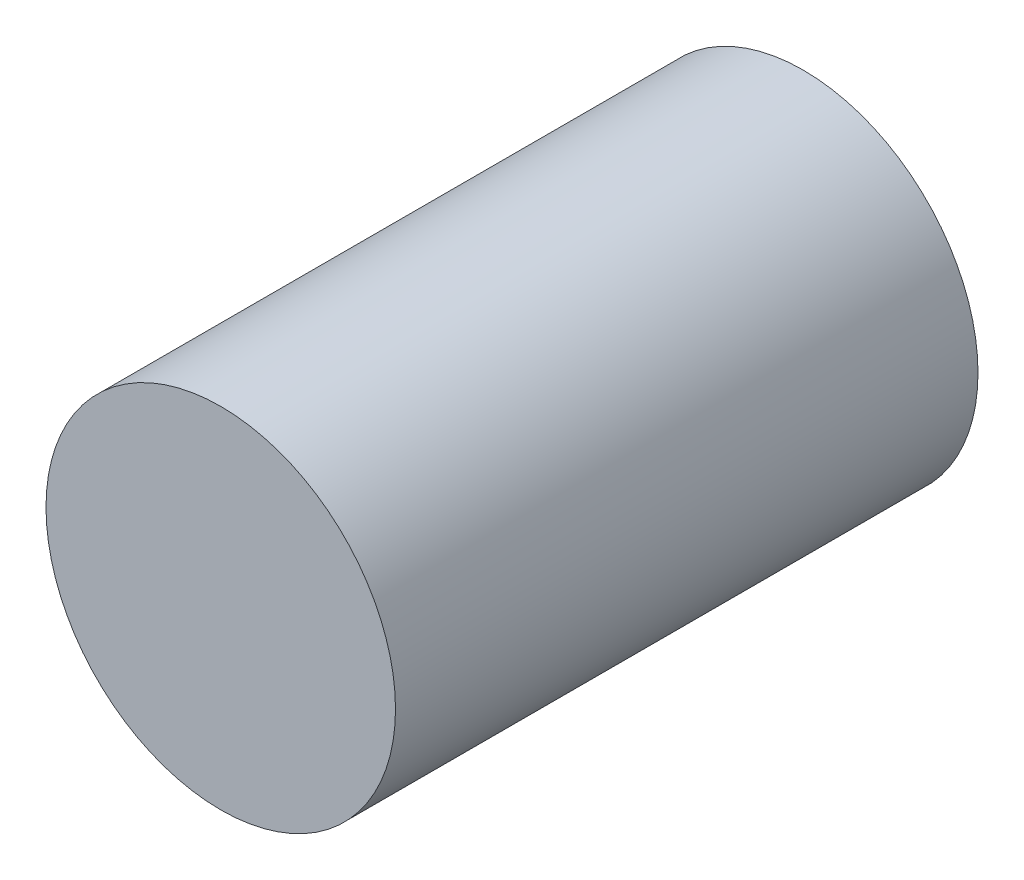
ISO-10303-21;
HEADER;
FILE_DESCRIPTION(('STEP AP214'),'2;1');
FILE_NAME('part.step','',(''),(''),'','','');
FILE_SCHEMA(('AUTOMOTIVE_DESIGN { 1 0 10303 214 1 1 1 1 }'));
ENDSEC;
DATA;
#1=APPLICATION_CONTEXT('core data for automotive mechanical design processes');
#2=APPLICATION_PROTOCOL_DEFINITION('international standard','automotive_design',2000,#1);
#3=PRODUCT_CONTEXT('',#1,'mechanical');
#4=PRODUCT('Part','Part','',(#3));
#5=PRODUCT_RELATED_PRODUCT_CATEGORY('part','',(#4));
#6=PRODUCT_DEFINITION_FORMATION('','',#4);
#7=PRODUCT_DEFINITION_CONTEXT('part definition',#1,'design');
#8=PRODUCT_DEFINITION('design','',#6,#7);
#9=PRODUCT_DEFINITION_SHAPE('','',#8);
#10=(LENGTH_UNIT() NAMED_UNIT(*) SI_UNIT(.MILLI.,.METRE.));
#11=(NAMED_UNIT(*) PLANE_ANGLE_UNIT() SI_UNIT($,.RADIAN.));
#12=(NAMED_UNIT(*) SI_UNIT($,.STERADIAN.) SOLID_ANGLE_UNIT());
#13=UNCERTAINTY_MEASURE_WITH_UNIT(LENGTH_MEASURE(1.E-05),#10,'distance_accuracy_value','');
#14=(GEOMETRIC_REPRESENTATION_CONTEXT(3) GLOBAL_UNCERTAINTY_ASSIGNED_CONTEXT((#13)) GLOBAL_UNIT_ASSIGNED_CONTEXT((#10,
#11,#12)) REPRESENTATION_CONTEXT('',''));
#15=CARTESIAN_POINT('',(0.,0.,0.));
#16=DIRECTION('',(0.,0.,1.));
#17=DIRECTION('',(1.,0.,0.));
#18=AXIS2_PLACEMENT_3D('',#15,#16,#17);
#19=CARTESIAN_POINT('',(0.,0.,50.));
#20=DIRECTION('',(0.,0.,-1.));
#21=DIRECTION('',(-1.,0.,0.));
#22=AXIS2_PLACEMENT_3D('',#19,#20,#21);
#23=CYLINDRICAL_SURFACE('',#22,15.);
#24=CARTESIAN_POINT('',(0.,-15.,29.9254234471279));
#25=CARTESIAN_POINT('',(0.272816814433608,-15.0000007650471,29.9254247157861));
#26=CARTESIAN_POINT('',(0.54562597269272,-14.9924884753769,29.9030221164919));
#27=CARTESIAN_POINT('',(1.08320880436489,-14.9632605101644,29.8142779030418));
#28=CARTESIAN_POINT('',(1.3479816405942,-14.941543360109,29.7479317273831));
#29=CARTESIAN_POINT('',(1.86166394750877,-14.8862653953208,29.5738272302078));
#30=CARTESIAN_POINT('',(2.11059912942976,-14.8527243865377,29.4661381348321));
#31=CARTESIAN_POINT('',(2.58687468402704,-14.7772222858721,29.2127175829356));
#32=CARTESIAN_POINT('',(2.81421078479507,-14.7352595334076,29.0669786221128));
#33=CARTESIAN_POINT('',(3.24870837510974,-14.6457047221309,28.7362944228363));
#34=CARTESIAN_POINT('',(3.45501850148552,-14.5979778231161,28.5502672758336));
#35=CARTESIAN_POINT('',(3.83416346351645,-14.5030157392292,28.1465876735869));
#36=CARTESIAN_POINT('',(4.00699092746984,-14.4557806648007,27.9289282724548));
#37=CARTESIAN_POINT('',(4.31912471111899,-14.3656666235818,27.4604978711728));
#38=CARTESIAN_POINT('',(4.45732429102252,-14.3229519627198,27.2089547485771));
#39=CARTESIAN_POINT('',(4.68909436930558,-14.2487652698844,26.684542974949));
#40=CARTESIAN_POINT('',(4.78267848691248,-14.2172898077928,26.4116808613493));
#41=CARTESIAN_POINT('',(4.91936730756488,-14.1705651637056,25.8620573396167));
#42=CARTESIAN_POINT('',(4.96406724136036,-14.1548047884338,25.5857374046681));
#43=CARTESIAN_POINT('',(5.00670561667087,-14.1397828315221,25.0291046763629));
#44=CARTESIAN_POINT('',(5.00465850803659,-14.1405161515599,24.748793143612));
#45=CARTESIAN_POINT('',(4.95509951850356,-14.1579507500054,24.2057402948667));
#46=CARTESIAN_POINT('',(4.90966956578088,-14.1739207918415,23.9427814324093));
#47=CARTESIAN_POINT('',(4.77803081419367,-14.2188328846856,23.4284563489773));
#48=CARTESIAN_POINT('',(4.69181713294739,-14.2477764887883,23.1770915199256));
#49=CARTESIAN_POINT('',(4.47969529031769,-14.3158955569848,22.6883596992082));
#50=CARTESIAN_POINT('',(4.35317024354078,-14.3552282897692,22.4512833197904));
#51=CARTESIAN_POINT('',(4.06444553151123,-14.4396279286729,22.0010689057191));
#52=CARTESIAN_POINT('',(3.9022355618188,-14.4846964894921,21.7879378124582));
#53=CARTESIAN_POINT('',(3.53674666341248,-14.5783664584198,21.379965456327));
#54=CARTESIAN_POINT('',(3.3317657503819,-14.6270294677509,21.1866599745833));
#55=CARTESIAN_POINT('',(2.89169784984998,-14.7203469193431,20.8367671138101));
#56=CARTESIAN_POINT('',(2.65660797830398,-14.765000976901,20.6801832563052));
#57=CARTESIAN_POINT('',(2.15973806523143,-14.8458553968921,20.4069419459528));
#58=CARTESIAN_POINT('',(1.89771638208171,-14.8819675004026,20.2906959904243));
#59=CARTESIAN_POINT('',(1.35634541682251,-14.9410283572211,20.1044075773493));
#60=CARTESIAN_POINT('',(1.07700219077476,-14.9639816827438,20.0343490700107));
#61=CARTESIAN_POINT('',(0.521919147646527,-14.9933813535722,19.9451451170161));
#62=CARTESIAN_POINT('',(0.246547999324233,-15.0005000916864,19.9239244012641));
#63=CARTESIAN_POINT('',(-0.303875349801188,-14.9994451347413,19.9270868151202));
#64=CARTESIAN_POINT('',(-0.578927596598252,-14.9912740209681,19.9514622470273));
#65=CARTESIAN_POINT('',(-1.11259933152128,-14.9610012358552,20.0434829858077));
#66=CARTESIAN_POINT('',(-1.37146403417422,-14.9393099355596,20.1098544773754));
#67=CARTESIAN_POINT('',(-1.87427979289787,-14.8845923415035,20.2823906694615));
#68=CARTESIAN_POINT('',(-2.11822894254303,-14.8515646023338,20.3885604444668));
#69=CARTESIAN_POINT('',(-2.59144148196637,-14.7764465643645,20.6407756063318));
#70=CARTESIAN_POINT('',(-2.82014979608574,-14.7341407377893,20.7877964135438));
#71=CARTESIAN_POINT('',(-3.25032415067793,-14.6452626958131,21.1163941971953));
#72=CARTESIAN_POINT('',(-3.45178183897788,-14.5986891796914,21.2979817272867));
#73=CARTESIAN_POINT('',(-3.8312625390315,-14.5038423990222,21.7003172021608));
#74=CARTESIAN_POINT('',(-4.00780484622885,-14.4555880543714,21.9224695817622));
#75=CARTESIAN_POINT('',(-4.32128761161787,-14.3649986647354,22.3942812861823));
#76=CARTESIAN_POINT('',(-4.45822773965506,-14.3226636691001,22.6439408402983));
#77=CARTESIAN_POINT('',(-4.68798465208181,-14.2491195895692,23.1637885235774));
#78=CARTESIAN_POINT('',(-4.78089066082511,-14.2178880396489,23.4339338429717));
#79=CARTESIAN_POINT('',(-4.91947333379678,-14.1705416153225,23.9873166973486));
#80=CARTESIAN_POINT('',(-4.9651712747697,-14.154419931182,24.2705482741497));
#81=CARTESIAN_POINT('',(-5.00638141238671,-14.1398929437089,24.8264089273325));
#82=CARTESIAN_POINT('',(-5.004351286542,-14.1406200128708,25.098835148562));
#83=CARTESIAN_POINT('',(-4.95621146724347,-14.1575634911934,25.6392488217382));
#84=CARTESIAN_POINT('',(-4.91010439729293,-14.1737789784681,25.9072365369033));
#85=CARTESIAN_POINT('',(-4.77685906564673,-14.2192262152446,26.4261017621403));
#86=CARTESIAN_POINT('',(-4.69051673007757,-14.2482049011239,26.6772075721504));
#87=CARTESIAN_POINT('',(-4.47989682879874,-14.3158199409234,27.1615604818192));
#88=CARTESIAN_POINT('',(-4.35561084276903,-14.3544584381697,27.3948036030679));
#89=CARTESIAN_POINT('',(-4.06630346291715,-14.4391414613023,27.8478417967425));
#90=CARTESIAN_POINT('',(-3.89974121382291,-14.4854355821068,28.0666059566198));
#91=CARTESIAN_POINT('',(-3.53321441567825,-14.5791678141626,28.4738725140489));
#92=CARTESIAN_POINT('',(-3.33324042225741,-14.6266062456186,28.6623663255683));
#93=CARTESIAN_POINT('',(-2.89620778460344,-14.7195015262772,29.0111455085738));
#94=CARTESIAN_POINT('',(-2.65800756749865,-14.7648090900628,29.1700451858829));
#95=CARTESIAN_POINT('',(-2.15678678703313,-14.8462995586306,29.4453755913811));
#96=CARTESIAN_POINT('',(-1.89377259066175,-14.8824847953965,29.5618171767381));
#97=CARTESIAN_POINT('',(-1.36246823600488,-14.9402757534271,29.7440316095713));
#98=CARTESIAN_POINT('',(-1.09493878838205,-14.9624606211261,29.8118357784448));
#99=CARTESIAN_POINT('',(-0.551602080051233,-14.9923203532111,29.9025248505135));
#100=CARTESIAN_POINT('',(-0.275797127843724,-14.9999992265953,29.9254221646106));
#101=CARTESIAN_POINT('',(0.,-15.,29.9254234471279));
#102=B_SPLINE_CURVE_WITH_KNOTS('',3,(#24,#25,#26,#27,#28,#29,#30,#31,#32,#33,#34,#35,#36,#37,
#38,#39,#40,#41,#42,#43,#44,#45,#46,#47,#48,#49,#50,#51,#52,#53,#54,#55,#56,#57,#58,#59,#60,#61,
#62,#63,#64,#65,#66,#67,#68,#69,#70,#71,#72,#73,#74,#75,#76,#77,#78,#79,#80,#81,#82,#83,#84,#85,
#86,#87,#88,#89,#90,#91,#92,#93,#94,#95,#96,#97,#98,#99,#100,#101),.UNSPECIFIED.,.T.,.F.,(4,2,2,
2,2,2,2,2,2,2,2,2,2,2,2,2,2,2,2,2,2,2,2,2,2,2,2,2,2,2,2,2,2,2,2,2,2,2,4),(0.,0.817435530130055,
1.6349559263376,2.45111336435137,3.2674318889955,4.1092342141378,4.95122166437651,
5.81741924118921,6.6833522346775,7.52009628712783,8.3565816994101,9.15484132763713,
9.95319654288061,10.764408557863,11.5758551280169,12.4296652906749,13.2835572984374,
14.1459202826244,15.0079834439669,15.832679158865,16.6572356583153,17.4579078990172,
18.2586822643117,19.0805199922933,19.9026090412011,20.7620511441441,21.6215004118563,
22.479200691445,23.3365142353985,24.1497833033194,24.9630039676753,25.7607793541274,
26.5587319089054,27.3915033346967,28.2245105562954,29.0899830418615,29.9552340577293,
30.7818279187972,31.6081933020135),.UNSPECIFIED.);
#103=CARTESIAN_POINT('',(0.,-15.,29.9254234471279));
#104=VERTEX_POINT('',#103);
#105=EDGE_CURVE('E40',#104,#104,#102,.T.);
#106=ORIENTED_EDGE('',*,*,#105,.T.);
#107=EDGE_LOOP('',(#106));
#108=FACE_BOUND('',#107,.T.);
#109=CARTESIAN_POINT('',(0.,0.,50.));
#110=DIRECTION('',(0.,0.,1.));
#111=DIRECTION('',(1.,0.,0.));
#112=AXIS2_PLACEMENT_3D('',#109,#110,#111);
#113=CIRCLE('',#112,15.);
#114=CARTESIAN_POINT('',(15.,0.,50.));
#115=VERTEX_POINT('',#114);
#116=EDGE_CURVE('E10',#115,#115,#113,.T.);
#117=ORIENTED_EDGE('',*,*,#116,.F.);
#118=EDGE_LOOP('',(#117));
#119=FACE_BOUND('',#118,.T.);
#120=CARTESIAN_POINT('',(0.,0.,0.));
#121=DIRECTION('',(0.,0.,1.));
#122=DIRECTION('',(1.,0.,0.));
#123=AXIS2_PLACEMENT_3D('',#120,#121,#122);
#124=CIRCLE('',#123,15.);
#125=CARTESIAN_POINT('',(15.,0.,0.));
#126=VERTEX_POINT('',#125);
#127=EDGE_CURVE('E48',#126,#126,#124,.T.);
#128=ORIENTED_EDGE('',*,*,#127,.T.);
#129=EDGE_LOOP('',(#128));
#130=FACE_BOUND('',#129,.T.);
#131=ADVANCED_FACE('F36',(#108,#119,#130),#23,.T.);
#132=CARTESIAN_POINT('',(0.,0.,50.));
#133=DIRECTION('',(0.,0.,1.));
#134=DIRECTION('',(1.,0.,0.));
#135=AXIS2_PLACEMENT_3D('',#132,#133,#134);
#136=PLANE('',#135);
#137=ORIENTED_EDGE('',*,*,#116,.T.);
#138=EDGE_LOOP('',(#137));
#139=FACE_BOUND('',#138,.T.);
#140=ADVANCED_FACE('F73',(#139),#136,.T.);
#141=CARTESIAN_POINT('',(0.,0.,0.));
#142=DIRECTION('',(0.,0.,1.));
#143=DIRECTION('',(1.,0.,0.));
#144=AXIS2_PLACEMENT_3D('',#141,#142,#143);
#145=PLANE('',#144);
#146=ORIENTED_EDGE('',*,*,#127,.F.);
#147=EDGE_LOOP('',(#146));
#148=FACE_BOUND('',#147,.T.);
#149=ADVANCED_FACE('F66',(#148),#145,.F.);
#150=CARTESIAN_POINT('',(0.,-50.,24.9254234471279));
#151=DIRECTION('',(0.,1.,0.));
#152=DIRECTION('',(0.,0.,1.));
#153=AXIS2_PLACEMENT_3D('',#150,#151,#152);
#154=CYLINDRICAL_SURFACE('',#153,5.);
#155=CARTESIAN_POINT('',(0.,0.,24.9254234471279));
#156=DIRECTION('',(0.,1.,0.));
#157=DIRECTION('',(0.,0.,1.));
#158=AXIS2_PLACEMENT_3D('',#155,#156,#157);
#159=CIRCLE('',#158,5.);
#160=CARTESIAN_POINT('',(0.,0.,29.9254234471279));
#161=VERTEX_POINT('',#160);
#162=EDGE_CURVE('E54',#161,#161,#159,.T.);
#163=ORIENTED_EDGE('',*,*,#162,.T.);
#164=EDGE_LOOP('',(#163));
#165=FACE_BOUND('',#164,.T.);
#166=ORIENTED_EDGE('',*,*,#105,.F.);
#167=EDGE_LOOP('',(#166));
#168=FACE_BOUND('',#167,.T.);
#169=ADVANCED_FACE('F63',(#165,#168),#154,.F.);
#170=CARTESIAN_POINT('',(0.,0.,24.9254234471279));
#171=DIRECTION('',(0.,1.,0.));
#172=DIRECTION('',(0.,0.,1.));
#173=AXIS2_PLACEMENT_3D('',#170,#171,#172);
#174=PLANE('',#173);
#175=ORIENTED_EDGE('',*,*,#162,.F.);
#176=EDGE_LOOP('',(#175));
#177=FACE_BOUND('',#176,.T.);
#178=ADVANCED_FACE('F65',(#177),#174,.F.);
#179=CLOSED_SHELL('',(#131,#140,#149,#169,#178));
#180=MANIFOLD_SOLID_BREP('B2',#179);
#181=ADVANCED_BREP_SHAPE_REPRESENTATION('',(#18,#180),#14);
#182=SHAPE_DEFINITION_REPRESENTATION(#9,#181);
ENDSEC;
END-ISO-10303-21;
